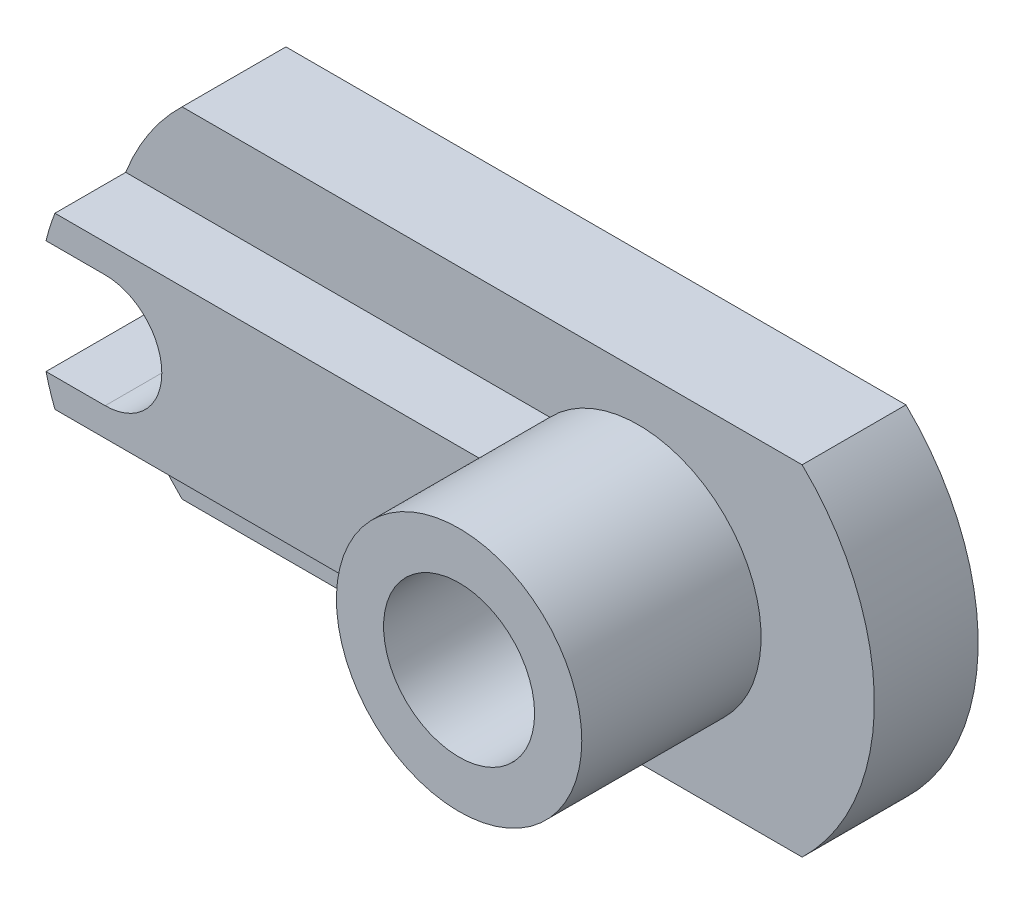
ISO-10303-21;
HEADER;
FILE_DESCRIPTION(('STEP AP214'),'2;1');
FILE_NAME('part.step','',(''),(''),'','','');
FILE_SCHEMA(('AUTOMOTIVE_DESIGN { 1 0 10303 214 1 1 1 1 }'));
ENDSEC;
DATA;
#1=APPLICATION_CONTEXT('core data for automotive mechanical design processes');
#2=APPLICATION_PROTOCOL_DEFINITION('international standard','automotive_design',2000,#1);
#3=PRODUCT_CONTEXT('',#1,'mechanical');
#4=PRODUCT('Part','Part','',(#3));
#5=PRODUCT_RELATED_PRODUCT_CATEGORY('part','',(#4));
#6=PRODUCT_DEFINITION_FORMATION('','',#4);
#7=PRODUCT_DEFINITION_CONTEXT('part definition',#1,'design');
#8=PRODUCT_DEFINITION('design','',#6,#7);
#9=PRODUCT_DEFINITION_SHAPE('','',#8);
#10=(LENGTH_UNIT() NAMED_UNIT(*) SI_UNIT(.MILLI.,.METRE.));
#11=(NAMED_UNIT(*) PLANE_ANGLE_UNIT() SI_UNIT($,.RADIAN.));
#12=(NAMED_UNIT(*) SI_UNIT($,.STERADIAN.) SOLID_ANGLE_UNIT());
#13=UNCERTAINTY_MEASURE_WITH_UNIT(LENGTH_MEASURE(1.E-05),#10,'distance_accuracy_value','');
#14=(GEOMETRIC_REPRESENTATION_CONTEXT(3) GLOBAL_UNCERTAINTY_ASSIGNED_CONTEXT((#13)) GLOBAL_UNIT_ASSIGNED_CONTEXT((#10,
#11,#12)) REPRESENTATION_CONTEXT('',''));
#15=CARTESIAN_POINT('',(0.,0.,0.));
#16=DIRECTION('',(0.,0.,1.));
#17=DIRECTION('',(1.,0.,0.));
#18=AXIS2_PLACEMENT_3D('',#15,#16,#17);
#19=CARTESIAN_POINT('',(-15.5,0.,-11.));
#20=DIRECTION('',(0.,0.,1.));
#21=DIRECTION('',(1.,0.,0.));
#22=AXIS2_PLACEMENT_3D('',#19,#20,#21);
#23=CYLINDRICAL_SURFACE('',#22,25.);
#24=CARTESIAN_POINT('',(-15.5,0.,0.));
#25=DIRECTION('',(0.,0.,1.));
#26=DIRECTION('',(1.,0.,0.));
#27=AXIS2_PLACEMENT_3D('',#24,#25,#26);
#28=CIRCLE('',#27,25.);
#29=CARTESIAN_POINT('',(-38.8238075793812,-9.,0.));
#30=VERTEX_POINT('',#29);
#31=CARTESIAN_POINT('',(-32.8493515728975,-18.,0.));
#32=VERTEX_POINT('',#31);
#33=EDGE_CURVE('E147',#30,#32,#28,.T.);
#34=ORIENTED_EDGE('',*,*,#33,.F.);
#35=DIRECTION('',(0.,0.,-1.));
#36=VECTOR('',#35,1.);
#37=CARTESIAN_POINT('',(-38.8238075793812,-9.,7.5));
#38=LINE('',#37,#36);
#39=CARTESIAN_POINT('',(-38.8238075793812,-9.,7.5));
#40=VERTEX_POINT('',#39);
#41=EDGE_CURVE('E198',#40,#30,#38,.T.);
#42=ORIENTED_EDGE('',*,*,#41,.F.);
#43=CARTESIAN_POINT('',(-15.5,0.,7.5));
#44=DIRECTION('',(0.,0.,1.));
#45=DIRECTION('',(1.,0.,0.));
#46=AXIS2_PLACEMENT_3D('',#43,#44,#45);
#47=CIRCLE('',#46,25.);
#48=CARTESIAN_POINT('',(-39.7693221990232,-6.,7.5));
#49=VERTEX_POINT('',#48);
#50=EDGE_CURVE('E281',#49,#40,#47,.T.);
#51=ORIENTED_EDGE('',*,*,#50,.F.);
#52=DIRECTION('',(0.,0.,1.));
#53=VECTOR('',#52,1.);
#54=CARTESIAN_POINT('',(-39.7693221990232,-6.,-11.));
#55=LINE('',#54,#53);
#56=CARTESIAN_POINT('',(-39.7693221990232,-6.,-11.));
#57=VERTEX_POINT('',#56);
#58=EDGE_CURVE('E11',#57,#49,#55,.T.);
#59=ORIENTED_EDGE('',*,*,#58,.F.);
#60=CARTESIAN_POINT('',(-15.5,0.,-11.));
#61=DIRECTION('',(0.,0.,1.));
#62=DIRECTION('',(1.,0.,0.));
#63=AXIS2_PLACEMENT_3D('',#60,#61,#62);
#64=CIRCLE('',#63,25.);
#65=CARTESIAN_POINT('',(-32.8493515728975,-18.,-11.));
#66=VERTEX_POINT('',#65);
#67=EDGE_CURVE('E160',#57,#66,#64,.T.);
#68=ORIENTED_EDGE('',*,*,#67,.T.);
#69=DIRECTION('',(0.,0.,1.));
#70=VECTOR('',#69,1.);
#71=CARTESIAN_POINT('',(-32.8493515728975,-18.,-11.));
#72=LINE('',#71,#70);
#73=EDGE_CURVE('E94',#66,#32,#72,.T.);
#74=ORIENTED_EDGE('',*,*,#73,.T.);
#75=EDGE_LOOP('',(#34,#42,#51,#59,#68,#74));
#76=FACE_BOUND('',#75,.T.);
#77=ADVANCED_FACE('F39',(#76),#23,.T.);
#78=CARTESIAN_POINT('',(-39.7693221990232,-6.,-11.));
#79=DIRECTION('',(0.,1.,0.));
#80=DIRECTION('',(0.,0.,1.));
#81=AXIS2_PLACEMENT_3D('',#78,#79,#80);
#82=PLANE('',#81);
#83=ORIENTED_EDGE('',*,*,#58,.T.);
#84=DIRECTION('',(-1.,0.,0.));
#85=VECTOR('',#84,1.);
#86=CARTESIAN_POINT('',(0.,-6.,7.5));
#87=LINE('',#86,#85);
#88=CARTESIAN_POINT('',(-33.5,-6.,7.5));
#89=VERTEX_POINT('',#88);
#90=EDGE_CURVE('E278',#89,#49,#87,.T.);
#91=ORIENTED_EDGE('',*,*,#90,.F.);
#92=DIRECTION('',(0.,0.,1.));
#93=VECTOR('',#92,1.);
#94=CARTESIAN_POINT('',(-33.5,-6.,-11.));
#95=LINE('',#94,#93);
#96=CARTESIAN_POINT('',(-33.5,-6.,-11.));
#97=VERTEX_POINT('',#96);
#98=EDGE_CURVE('E47',#97,#89,#95,.T.);
#99=ORIENTED_EDGE('',*,*,#98,.F.);
#100=DIRECTION('',(-1.,0.,0.));
#101=VECTOR('',#100,1.);
#102=CARTESIAN_POINT('',(-39.7693221990232,-6.,-11.));
#103=LINE('',#102,#101);
#104=EDGE_CURVE('E136',#97,#57,#103,.T.);
#105=ORIENTED_EDGE('',*,*,#104,.T.);
#106=EDGE_LOOP('',(#83,#91,#99,#105));
#107=FACE_BOUND('',#106,.T.);
#108=ADVANCED_FACE('F238',(#107),#82,.T.);
#109=CARTESIAN_POINT('',(-33.5,0.,-11.));
#110=DIRECTION('',(0.,0.,1.));
#111=DIRECTION('',(1.,0.,0.));
#112=AXIS2_PLACEMENT_3D('',#109,#110,#111);
#113=CYLINDRICAL_SURFACE('',#112,6.);
#114=ORIENTED_EDGE('',*,*,#98,.T.);
#115=CARTESIAN_POINT('',(-33.5,0.,7.5));
#116=DIRECTION('',(0.,0.,1.));
#117=DIRECTION('',(1.,0.,0.));
#118=AXIS2_PLACEMENT_3D('',#115,#116,#117);
#119=CIRCLE('',#118,6.);
#120=CARTESIAN_POINT('',(-33.5,6.,7.5));
#121=VERTEX_POINT('',#120);
#122=EDGE_CURVE('E122',#121,#89,#119,.F.);
#123=ORIENTED_EDGE('',*,*,#122,.F.);
#124=DIRECTION('',(0.,0.,1.));
#125=VECTOR('',#124,1.);
#126=CARTESIAN_POINT('',(-33.5,6.,-11.));
#127=LINE('',#126,#125);
#128=CARTESIAN_POINT('',(-33.5,6.,-11.));
#129=VERTEX_POINT('',#128);
#130=EDGE_CURVE('E114',#129,#121,#127,.T.);
#131=ORIENTED_EDGE('',*,*,#130,.F.);
#132=CARTESIAN_POINT('',(-33.5,0.,-11.));
#133=DIRECTION('',(0.,0.,-1.));
#134=DIRECTION('',(-1.,0.,0.));
#135=AXIS2_PLACEMENT_3D('',#132,#133,#134);
#136=CIRCLE('',#135,6.);
#137=EDGE_CURVE('E118',#129,#97,#136,.T.);
#138=ORIENTED_EDGE('',*,*,#137,.T.);
#139=EDGE_LOOP('',(#114,#123,#131,#138));
#140=FACE_BOUND('',#139,.T.);
#141=ADVANCED_FACE('F117',(#140),#113,.F.);
#142=CARTESIAN_POINT('',(-39.7693221990232,6.,-11.));
#143=DIRECTION('',(0.,-1.,0.));
#144=DIRECTION('',(0.,0.,-1.));
#145=AXIS2_PLACEMENT_3D('',#142,#143,#144);
#146=PLANE('',#145);
#147=ORIENTED_EDGE('',*,*,#130,.T.);
#148=DIRECTION('',(1.,0.,0.));
#149=VECTOR('',#148,1.);
#150=CARTESIAN_POINT('',(0.,6.,7.5));
#151=LINE('',#150,#149);
#152=CARTESIAN_POINT('',(-39.7693221990232,6.,7.5));
#153=VERTEX_POINT('',#152);
#154=EDGE_CURVE('E275',#153,#121,#151,.T.);
#155=ORIENTED_EDGE('',*,*,#154,.F.);
#156=DIRECTION('',(0.,0.,1.));
#157=VECTOR('',#156,1.);
#158=CARTESIAN_POINT('',(-39.7693221990232,5.99999999999999,-11.));
#159=LINE('',#158,#157);
#160=CARTESIAN_POINT('',(-39.7693221990232,5.99999999999999,-11.));
#161=VERTEX_POINT('',#160);
#162=EDGE_CURVE('E127',#161,#153,#159,.T.);
#163=ORIENTED_EDGE('',*,*,#162,.F.);
#164=DIRECTION('',(1.,0.,0.));
#165=VECTOR('',#164,1.);
#166=CARTESIAN_POINT('',(-39.7693221990232,6.,-11.));
#167=LINE('',#166,#165);
#168=EDGE_CURVE('E133',#161,#129,#167,.T.);
#169=ORIENTED_EDGE('',*,*,#168,.T.);
#170=EDGE_LOOP('',(#147,#155,#163,#169));
#171=FACE_BOUND('',#170,.T.);
#172=ADVANCED_FACE('F138',(#171),#146,.T.);
#173=CARTESIAN_POINT('',(-15.5,0.,-11.));
#174=DIRECTION('',(0.,0.,1.));
#175=DIRECTION('',(1.,0.,0.));
#176=AXIS2_PLACEMENT_3D('',#173,#174,#175);
#177=CYLINDRICAL_SURFACE('',#176,25.);
#178=CARTESIAN_POINT('',(-15.5,0.,0.));
#179=DIRECTION('',(0.,0.,1.));
#180=DIRECTION('',(1.,0.,0.));
#181=AXIS2_PLACEMENT_3D('',#178,#179,#180);
#182=CIRCLE('',#181,25.);
#183=CARTESIAN_POINT('',(-32.8493515728975,18.,0.));
#184=VERTEX_POINT('',#183);
#185=CARTESIAN_POINT('',(-38.8238075793812,9.,0.));
#186=VERTEX_POINT('',#185);
#187=EDGE_CURVE('E158',#184,#186,#182,.T.);
#188=ORIENTED_EDGE('',*,*,#187,.F.);
#189=DIRECTION('',(0.,0.,1.));
#190=VECTOR('',#189,1.);
#191=CARTESIAN_POINT('',(-32.8493515728975,18.,-11.));
#192=LINE('',#191,#190);
#193=CARTESIAN_POINT('',(-32.8493515728975,18.,-11.));
#194=VERTEX_POINT('',#193);
#195=EDGE_CURVE('E85',#194,#184,#192,.T.);
#196=ORIENTED_EDGE('',*,*,#195,.F.);
#197=CARTESIAN_POINT('',(-15.5,0.,-11.));
#198=DIRECTION('',(0.,0.,1.));
#199=DIRECTION('',(1.,0.,0.));
#200=AXIS2_PLACEMENT_3D('',#197,#198,#199);
#201=CIRCLE('',#200,25.);
#202=EDGE_CURVE('E140',#194,#161,#201,.T.);
#203=ORIENTED_EDGE('',*,*,#202,.T.);
#204=ORIENTED_EDGE('',*,*,#162,.T.);
#205=CARTESIAN_POINT('',(-15.5,0.,7.5));
#206=DIRECTION('',(0.,0.,1.));
#207=DIRECTION('',(1.,0.,0.));
#208=AXIS2_PLACEMENT_3D('',#205,#206,#207);
#209=CIRCLE('',#208,25.);
#210=CARTESIAN_POINT('',(-38.8238075793812,9.,7.5));
#211=VERTEX_POINT('',#210);
#212=EDGE_CURVE('E223',#211,#153,#209,.T.);
#213=ORIENTED_EDGE('',*,*,#212,.F.);
#214=DIRECTION('',(0.,0.,-1.));
#215=VECTOR('',#214,1.);
#216=CARTESIAN_POINT('',(-38.8238075793812,9.,7.5));
#217=LINE('',#216,#215);
#218=EDGE_CURVE('E201',#211,#186,#217,.T.);
#219=ORIENTED_EDGE('',*,*,#218,.T.);
#220=EDGE_LOOP('',(#188,#196,#203,#204,#213,#219));
#221=FACE_BOUND('',#220,.T.);
#222=ADVANCED_FACE('F218',(#221),#177,.T.);
#223=CARTESIAN_POINT('',(32.8493515728975,18.,-11.));
#224=DIRECTION('',(0.,1.,0.));
#225=DIRECTION('',(-1.,0.,0.));
#226=AXIS2_PLACEMENT_3D('',#223,#224,#225);
#227=PLANE('',#226);
#228=DIRECTION('',(-1.,0.,0.));
#229=VECTOR('',#228,1.);
#230=CARTESIAN_POINT('',(32.8493515728975,18.,0.));
#231=LINE('',#230,#229);
#232=CARTESIAN_POINT('',(32.8493515728975,18.,0.));
#233=VERTEX_POINT('',#232);
#234=EDGE_CURVE('E155',#233,#184,#231,.T.);
#235=ORIENTED_EDGE('',*,*,#234,.F.);
#236=DIRECTION('',(0.,0.,1.));
#237=VECTOR('',#236,1.);
#238=CARTESIAN_POINT('',(32.8493515728975,18.,-11.));
#239=LINE('',#238,#237);
#240=CARTESIAN_POINT('',(32.8493515728975,18.,-11.));
#241=VERTEX_POINT('',#240);
#242=EDGE_CURVE('E165',#241,#233,#239,.T.);
#243=ORIENTED_EDGE('',*,*,#242,.F.);
#244=DIRECTION('',(-1.,0.,0.));
#245=VECTOR('',#244,1.);
#246=CARTESIAN_POINT('',(32.8493515728975,18.,-11.));
#247=LINE('',#246,#245);
#248=EDGE_CURVE('E142',#241,#194,#247,.T.);
#249=ORIENTED_EDGE('',*,*,#248,.T.);
#250=ORIENTED_EDGE('',*,*,#195,.T.);
#251=EDGE_LOOP('',(#235,#243,#249,#250));
#252=FACE_BOUND('',#251,.T.);
#253=ADVANCED_FACE('F211',(#252),#227,.T.);
#254=CARTESIAN_POINT('',(15.5,0.,-11.));
#255=DIRECTION('',(0.,0.,1.));
#256=DIRECTION('',(1.,0.,0.));
#257=AXIS2_PLACEMENT_3D('',#254,#255,#256);
#258=CYLINDRICAL_SURFACE('',#257,25.);
#259=CARTESIAN_POINT('',(15.5,0.,0.));
#260=DIRECTION('',(0.,0.,1.));
#261=DIRECTION('',(1.,0.,0.));
#262=AXIS2_PLACEMENT_3D('',#259,#260,#261);
#263=CIRCLE('',#262,25.);
#264=CARTESIAN_POINT('',(32.8493515728975,-18.,0.));
#265=VERTEX_POINT('',#264);
#266=EDGE_CURVE('E152',#265,#233,#263,.T.);
#267=ORIENTED_EDGE('',*,*,#266,.F.);
#268=DIRECTION('',(0.,0.,1.));
#269=VECTOR('',#268,1.);
#270=CARTESIAN_POINT('',(32.8493515728975,-18.,-11.));
#271=LINE('',#270,#269);
#272=CARTESIAN_POINT('',(32.8493515728975,-18.,-11.));
#273=VERTEX_POINT('',#272);
#274=EDGE_CURVE('E167',#273,#265,#271,.T.);
#275=ORIENTED_EDGE('',*,*,#274,.F.);
#276=CARTESIAN_POINT('',(15.5,0.,-11.));
#277=DIRECTION('',(0.,0.,1.));
#278=DIRECTION('',(1.,0.,0.));
#279=AXIS2_PLACEMENT_3D('',#276,#277,#278);
#280=CIRCLE('',#279,25.);
#281=EDGE_CURVE('E208',#273,#241,#280,.T.);
#282=ORIENTED_EDGE('',*,*,#281,.T.);
#283=ORIENTED_EDGE('',*,*,#242,.T.);
#284=EDGE_LOOP('',(#267,#275,#282,#283));
#285=FACE_BOUND('',#284,.T.);
#286=ADVANCED_FACE('F214',(#285),#258,.T.);
#287=CARTESIAN_POINT('',(-32.8493515728975,-18.,-11.));
#288=DIRECTION('',(0.,-1.,0.));
#289=DIRECTION('',(1.,0.,0.));
#290=AXIS2_PLACEMENT_3D('',#287,#288,#289);
#291=PLANE('',#290);
#292=DIRECTION('',(1.,0.,0.));
#293=VECTOR('',#292,1.);
#294=CARTESIAN_POINT('',(-32.8493515728975,-18.,0.));
#295=LINE('',#294,#293);
#296=EDGE_CURVE('E149',#32,#265,#295,.T.);
#297=ORIENTED_EDGE('',*,*,#296,.F.);
#298=ORIENTED_EDGE('',*,*,#73,.F.);
#299=DIRECTION('',(1.,0.,0.));
#300=VECTOR('',#299,1.);
#301=CARTESIAN_POINT('',(-32.8493515728975,-18.,-11.));
#302=LINE('',#301,#300);
#303=EDGE_CURVE('E206',#66,#273,#302,.T.);
#304=ORIENTED_EDGE('',*,*,#303,.T.);
#305=ORIENTED_EDGE('',*,*,#274,.T.);
#306=EDGE_LOOP('',(#297,#298,#304,#305));
#307=FACE_BOUND('',#306,.T.);
#308=ADVANCED_FACE('F171',(#307),#291,.T.);
#309=CARTESIAN_POINT('',(-15.5,0.,-11.));
#310=DIRECTION('',(0.,0.,1.));
#311=DIRECTION('',(1.,0.,0.));
#312=AXIS2_PLACEMENT_3D('',#309,#310,#311);
#313=PLANE('',#312);
#314=CARTESIAN_POINT('',(15.5,0.,-11.));
#315=DIRECTION('',(0.,0.,1.));
#316=DIRECTION('',(1.,0.,0.));
#317=AXIS2_PLACEMENT_3D('',#314,#315,#316);
#318=CIRCLE('',#317,8.);
#319=CARTESIAN_POINT('',(23.5,0.,-11.));
#320=VERTEX_POINT('',#319);
#321=EDGE_CURVE('E42',#320,#320,#318,.T.);
#322=ORIENTED_EDGE('',*,*,#321,.T.);
#323=EDGE_LOOP('',(#322));
#324=FACE_BOUND('',#323,.T.);
#325=ORIENTED_EDGE('',*,*,#67,.F.);
#326=ORIENTED_EDGE('',*,*,#104,.F.);
#327=ORIENTED_EDGE('',*,*,#137,.F.);
#328=ORIENTED_EDGE('',*,*,#168,.F.);
#329=ORIENTED_EDGE('',*,*,#202,.F.);
#330=ORIENTED_EDGE('',*,*,#248,.F.);
#331=ORIENTED_EDGE('',*,*,#281,.F.);
#332=ORIENTED_EDGE('',*,*,#303,.F.);
#333=EDGE_LOOP('',(#325,#326,#327,#328,#329,#330,#331,#332));
#334=FACE_BOUND('',#333,.T.);
#335=ADVANCED_FACE('F131',(#324,#334),#313,.F.);
#336=CARTESIAN_POINT('',(-15.5,0.,0.));
#337=DIRECTION('',(0.,0.,1.));
#338=DIRECTION('',(1.,0.,0.));
#339=AXIS2_PLACEMENT_3D('',#336,#337,#338);
#340=PLANE('',#339);
#341=DIRECTION('',(1.,0.,0.));
#342=VECTOR('',#341,1.);
#343=CARTESIAN_POINT('',(0.,9.,0.));
#344=LINE('',#343,#342);
#345=CARTESIAN_POINT('',(6.11916848035313,9.,0.));
#346=VERTEX_POINT('',#345);
#347=EDGE_CURVE('E187',#186,#346,#344,.T.);
#348=ORIENTED_EDGE('',*,*,#347,.T.);
#349=CARTESIAN_POINT('',(15.5,0.,0.));
#350=DIRECTION('',(0.,0.,1.));
#351=DIRECTION('',(1.,0.,0.));
#352=AXIS2_PLACEMENT_3D('',#349,#350,#351);
#353=CIRCLE('',#352,13.);
#354=CARTESIAN_POINT('',(6.11916848035313,-9.,0.));
#355=VERTEX_POINT('',#354);
#356=EDGE_CURVE('E180',#355,#346,#353,.T.);
#357=ORIENTED_EDGE('',*,*,#356,.F.);
#358=DIRECTION('',(1.,0.,0.));
#359=VECTOR('',#358,1.);
#360=CARTESIAN_POINT('',(0.,-9.,0.));
#361=LINE('',#360,#359);
#362=EDGE_CURVE('E178',#30,#355,#361,.T.);
#363=ORIENTED_EDGE('',*,*,#362,.F.);
#364=ORIENTED_EDGE('',*,*,#33,.T.);
#365=ORIENTED_EDGE('',*,*,#296,.T.);
#366=ORIENTED_EDGE('',*,*,#266,.T.);
#367=ORIENTED_EDGE('',*,*,#234,.T.);
#368=ORIENTED_EDGE('',*,*,#187,.T.);
#369=EDGE_LOOP('',(#348,#357,#363,#364,#365,#366,#367,#368));
#370=FACE_BOUND('',#369,.T.);
#371=ADVANCED_FACE('F174',(#370),#340,.T.);
#372=CARTESIAN_POINT('',(0.,9.,7.5));
#373=DIRECTION('',(0.,1.,0.));
#374=DIRECTION('',(0.,0.,1.));
#375=AXIS2_PLACEMENT_3D('',#372,#373,#374);
#376=PLANE('',#375);
#377=ORIENTED_EDGE('',*,*,#347,.F.);
#378=ORIENTED_EDGE('',*,*,#218,.F.);
#379=DIRECTION('',(1.,0.,0.));
#380=VECTOR('',#379,1.);
#381=CARTESIAN_POINT('',(0.,9.,7.5));
#382=LINE('',#381,#380);
#383=CARTESIAN_POINT('',(6.11916848035313,9.,7.5));
#384=VERTEX_POINT('',#383);
#385=EDGE_CURVE('E190',#211,#384,#382,.T.);
#386=ORIENTED_EDGE('',*,*,#385,.T.);
#387=DIRECTION('',(0.,0.,-1.));
#388=VECTOR('',#387,1.);
#389=CARTESIAN_POINT('',(6.11916848035313,9.,7.5));
#390=LINE('',#389,#388);
#391=EDGE_CURVE('E55',#384,#346,#390,.T.);
#392=ORIENTED_EDGE('',*,*,#391,.T.);
#393=EDGE_LOOP('',(#377,#378,#386,#392));
#394=FACE_BOUND('',#393,.T.);
#395=ADVANCED_FACE('F225',(#394),#376,.T.);
#396=CARTESIAN_POINT('',(0.,-9.,7.5));
#397=DIRECTION('',(0.,1.,0.));
#398=DIRECTION('',(0.,0.,1.));
#399=AXIS2_PLACEMENT_3D('',#396,#397,#398);
#400=PLANE('',#399);
#401=ORIENTED_EDGE('',*,*,#362,.T.);
#402=DIRECTION('',(0.,0.,-1.));
#403=VECTOR('',#402,1.);
#404=CARTESIAN_POINT('',(6.11916848035313,-9.,7.5));
#405=LINE('',#404,#403);
#406=CARTESIAN_POINT('',(6.11916848035314,-9.,7.5));
#407=VERTEX_POINT('',#406);
#408=EDGE_CURVE('E196',#407,#355,#405,.T.);
#409=ORIENTED_EDGE('',*,*,#408,.F.);
#410=DIRECTION('',(1.,0.,0.));
#411=VECTOR('',#410,1.);
#412=CARTESIAN_POINT('',(0.,-9.,7.5));
#413=LINE('',#412,#411);
#414=EDGE_CURVE('E199',#40,#407,#413,.T.);
#415=ORIENTED_EDGE('',*,*,#414,.F.);
#416=ORIENTED_EDGE('',*,*,#41,.T.);
#417=EDGE_LOOP('',(#401,#409,#415,#416));
#418=FACE_BOUND('',#417,.T.);
#419=ADVANCED_FACE('F227',(#418),#400,.F.);
#420=CARTESIAN_POINT('',(0.,0.,7.5));
#421=DIRECTION('',(0.,0.,1.));
#422=DIRECTION('',(1.,0.,0.));
#423=AXIS2_PLACEMENT_3D('',#420,#421,#422);
#424=PLANE('',#423);
#425=CARTESIAN_POINT('',(15.5,0.,7.5));
#426=DIRECTION('',(0.,0.,1.));
#427=DIRECTION('',(1.,0.,0.));
#428=AXIS2_PLACEMENT_3D('',#425,#426,#427);
#429=CIRCLE('',#428,13.);
#430=EDGE_CURVE('E186',#384,#407,#429,.T.);
#431=ORIENTED_EDGE('',*,*,#430,.F.);
#432=ORIENTED_EDGE('',*,*,#385,.F.);
#433=ORIENTED_EDGE('',*,*,#212,.T.);
#434=ORIENTED_EDGE('',*,*,#154,.T.);
#435=ORIENTED_EDGE('',*,*,#122,.T.);
#436=ORIENTED_EDGE('',*,*,#90,.T.);
#437=ORIENTED_EDGE('',*,*,#50,.T.);
#438=ORIENTED_EDGE('',*,*,#414,.T.);
#439=EDGE_LOOP('',(#431,#432,#433,#434,#435,#436,#437,#438));
#440=FACE_BOUND('',#439,.T.);
#441=ADVANCED_FACE('F233',(#440),#424,.T.);
#442=CARTESIAN_POINT('',(15.5,0.,19.));
#443=DIRECTION('',(0.,0.,-1.));
#444=DIRECTION('',(-1.,0.,0.));
#445=AXIS2_PLACEMENT_3D('',#442,#443,#444);
#446=CYLINDRICAL_SURFACE('',#445,8.);
#447=CARTESIAN_POINT('',(15.5,0.,19.));
#448=DIRECTION('',(0.,0.,1.));
#449=DIRECTION('',(1.,0.,0.));
#450=AXIS2_PLACEMENT_3D('',#447,#448,#449);
#451=CIRCLE('',#450,8.);
#452=CARTESIAN_POINT('',(23.5,0.,19.));
#453=VERTEX_POINT('',#452);
#454=EDGE_CURVE('E266',#453,#453,#451,.T.);
#455=ORIENTED_EDGE('',*,*,#454,.T.);
#456=EDGE_LOOP('',(#455));
#457=FACE_BOUND('',#456,.T.);
#458=ORIENTED_EDGE('',*,*,#321,.F.);
#459=EDGE_LOOP('',(#458));
#460=FACE_BOUND('',#459,.T.);
#461=ADVANCED_FACE('F304',(#457,#460),#446,.F.);
#462=CARTESIAN_POINT('',(15.5,0.,19.));
#463=DIRECTION('',(0.,0.,-1.));
#464=DIRECTION('',(-1.,0.,0.));
#465=AXIS2_PLACEMENT_3D('',#462,#463,#464);
#466=CYLINDRICAL_SURFACE('',#465,13.);
#467=ORIENTED_EDGE('',*,*,#391,.F.);
#468=ORIENTED_EDGE('',*,*,#430,.T.);
#469=ORIENTED_EDGE('',*,*,#408,.T.);
#470=ORIENTED_EDGE('',*,*,#356,.T.);
#471=EDGE_LOOP('',(#467,#468,#469,#470));
#472=FACE_BOUND('',#471,.T.);
#473=CARTESIAN_POINT('',(15.5,0.,19.));
#474=DIRECTION('',(0.,0.,1.));
#475=DIRECTION('',(1.,0.,0.));
#476=AXIS2_PLACEMENT_3D('',#473,#474,#475);
#477=CIRCLE('',#476,13.);
#478=CARTESIAN_POINT('',(28.5,0.,19.));
#479=VERTEX_POINT('',#478);
#480=EDGE_CURVE('E192',#479,#479,#477,.T.);
#481=ORIENTED_EDGE('',*,*,#480,.F.);
#482=EDGE_LOOP('',(#481));
#483=FACE_BOUND('',#482,.T.);
#484=ADVANCED_FACE('F289',(#472,#483),#466,.T.);
#485=CARTESIAN_POINT('',(0.,0.,19.));
#486=DIRECTION('',(0.,0.,1.));
#487=DIRECTION('',(1.,0.,0.));
#488=AXIS2_PLACEMENT_3D('',#485,#486,#487);
#489=PLANE('',#488);
#490=ORIENTED_EDGE('',*,*,#454,.F.);
#491=EDGE_LOOP('',(#490));
#492=FACE_BOUND('',#491,.T.);
#493=ORIENTED_EDGE('',*,*,#480,.T.);
#494=EDGE_LOOP('',(#493));
#495=FACE_BOUND('',#494,.T.);
#496=ADVANCED_FACE('F303',(#492,#495),#489,.T.);
#497=CLOSED_SHELL('',(#77,#108,#141,#172,#222,#253,#286,#308,#335,#371,#395,#419,#441,#461,#484,#496));
#498=MANIFOLD_SOLID_BREP('B2',#497);
#499=ADVANCED_BREP_SHAPE_REPRESENTATION('',(#18,#498),#14);
#500=SHAPE_DEFINITION_REPRESENTATION(#9,#499);
ENDSEC;
END-ISO-10303-21;
